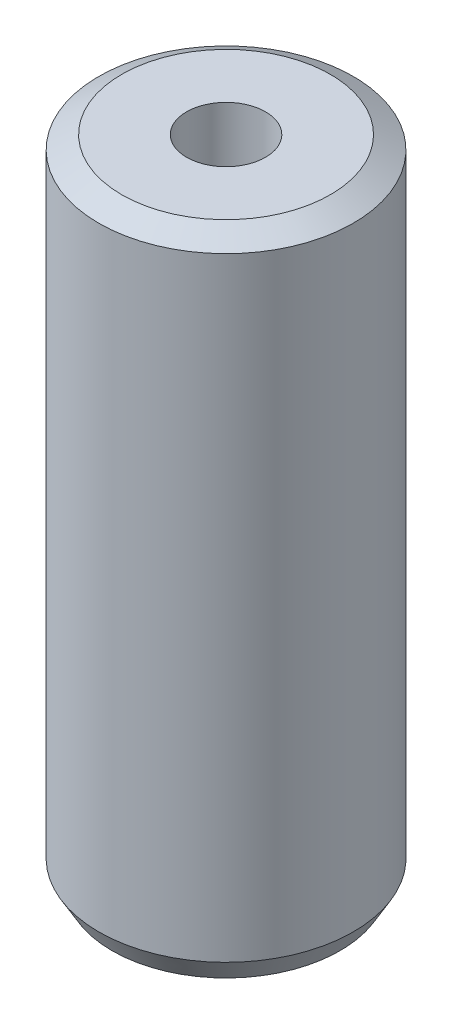
ISO-10303-21;
HEADER;
FILE_DESCRIPTION(('STEP AP214'),'2;1');
FILE_NAME('part.step','',(''),(''),'','','');
FILE_SCHEMA(('AUTOMOTIVE_DESIGN { 1 0 10303 214 1 1 1 1 }'));
ENDSEC;
DATA;
#1=APPLICATION_CONTEXT('core data for automotive mechanical design processes');
#2=APPLICATION_PROTOCOL_DEFINITION('international standard','automotive_design',2000,#1);
#3=PRODUCT_CONTEXT('',#1,'mechanical');
#4=PRODUCT('Part','Part','',(#3));
#5=PRODUCT_RELATED_PRODUCT_CATEGORY('part','',(#4));
#6=PRODUCT_DEFINITION_FORMATION('','',#4);
#7=PRODUCT_DEFINITION_CONTEXT('part definition',#1,'design');
#8=PRODUCT_DEFINITION('design','',#6,#7);
#9=PRODUCT_DEFINITION_SHAPE('','',#8);
#10=(LENGTH_UNIT() NAMED_UNIT(*) SI_UNIT(.MILLI.,.METRE.));
#11=(NAMED_UNIT(*) PLANE_ANGLE_UNIT() SI_UNIT($,.RADIAN.));
#12=(NAMED_UNIT(*) SI_UNIT($,.STERADIAN.) SOLID_ANGLE_UNIT());
#13=UNCERTAINTY_MEASURE_WITH_UNIT(LENGTH_MEASURE(1.E-05),#10,'distance_accuracy_value','');
#14=(GEOMETRIC_REPRESENTATION_CONTEXT(3) GLOBAL_UNCERTAINTY_ASSIGNED_CONTEXT((#13)) GLOBAL_UNIT_ASSIGNED_CONTEXT((#10,
#11,#12)) REPRESENTATION_CONTEXT('',''));
#15=CARTESIAN_POINT('',(0.,0.,0.));
#16=DIRECTION('',(0.,0.,1.));
#17=DIRECTION('',(1.,0.,0.));
#18=AXIS2_PLACEMENT_3D('',#15,#16,#17);
#19=CARTESIAN_POINT('',(0.,89.3925338737181,0.));
#20=DIRECTION('',(0.,-1.,0.));
#21=DIRECTION('',(0.,0.,-1.));
#22=AXIS2_PLACEMENT_3D('',#19,#20,#21);
#23=CYLINDRICAL_SURFACE('',#22,17.5);
#24=CARTESIAN_POINT('',(0.,87.5722599533696,0.));
#25=DIRECTION('',(0.,1.,0.));
#26=DIRECTION('',(0.,0.,1.));
#27=AXIS2_PLACEMENT_3D('',#24,#25,#26);
#28=CIRCLE('',#27,17.5);
#29=CARTESIAN_POINT('',(0.,87.5722599533696,17.5));
#30=VERTEX_POINT('',#29);
#31=EDGE_CURVE('E50',#30,#30,#28,.F.);
#32=ORIENTED_EDGE('',*,*,#31,.T.);
#33=EDGE_LOOP('',(#32));
#34=FACE_BOUND('',#33,.T.);
#35=CARTESIAN_POINT('',(0.,3.15280691373623,0.));
#36=DIRECTION('',(0.,1.,0.));
#37=DIRECTION('',(0.,0.,1.));
#38=AXIS2_PLACEMENT_3D('',#35,#36,#37);
#39=CIRCLE('',#38,17.5);
#40=CARTESIAN_POINT('',(0.,3.15280691373623,17.5));
#41=VERTEX_POINT('',#40);
#42=EDGE_CURVE('E51',#41,#41,#39,.T.);
#43=ORIENTED_EDGE('',*,*,#42,.T.);
#44=EDGE_LOOP('',(#43));
#45=FACE_BOUND('',#44,.T.);
#46=ADVANCED_FACE('F39',(#34,#45),#23,.T.);
#47=CARTESIAN_POINT('',(0.,89.3925338737181,0.));
#48=DIRECTION('',(0.,1.,0.));
#49=DIRECTION('',(0.,0.,1.));
#50=AXIS2_PLACEMENT_3D('',#47,#48,#49);
#51=PLANE('',#50);
#52=CARTESIAN_POINT('',(0.,89.3925338737181,0.));
#53=DIRECTION('',(0.,1.,0.));
#54=DIRECTION('',(0.,0.,1.));
#55=AXIS2_PLACEMENT_3D('',#52,#53,#54);
#56=CIRCLE('',#55,14.3471930862637);
#57=CARTESIAN_POINT('',(0.,89.3925338737181,14.3471930862637));
#58=VERTEX_POINT('',#57);
#59=EDGE_CURVE('E54',#58,#58,#56,.T.);
#60=ORIENTED_EDGE('',*,*,#59,.T.);
#61=EDGE_LOOP('',(#60));
#62=FACE_BOUND('',#61,.T.);
#63=CARTESIAN_POINT('',(0.,89.3925338737181,0.));
#64=DIRECTION('',(0.,1.,0.));
#65=DIRECTION('',(0.,0.,1.));
#66=AXIS2_PLACEMENT_3D('',#63,#64,#65);
#67=CIRCLE('',#66,5.42739893584074);
#68=CARTESIAN_POINT('',(0.,89.3925338737181,5.42739893584074));
#69=VERTEX_POINT('',#68);
#70=EDGE_CURVE('E58',#69,#69,#67,.T.);
#71=ORIENTED_EDGE('',*,*,#70,.F.);
#72=EDGE_LOOP('',(#71));
#73=FACE_BOUND('',#72,.T.);
#74=ADVANCED_FACE('F69',(#62,#73),#51,.T.);
#75=CARTESIAN_POINT('',(0.,0.,0.));
#76=DIRECTION('',(0.,1.,0.));
#77=DIRECTION('',(0.,0.,1.));
#78=AXIS2_PLACEMENT_3D('',#75,#76,#77);
#79=PLANE('',#78);
#80=CARTESIAN_POINT('',(0.,0.,0.));
#81=DIRECTION('',(0.,1.,0.));
#82=DIRECTION('',(0.,0.,1.));
#83=AXIS2_PLACEMENT_3D('',#80,#81,#82);
#84=CIRCLE('',#83,15.6797260796515);
#85=CARTESIAN_POINT('',(0.,0.,15.6797260796515));
#86=VERTEX_POINT('',#85);
#87=EDGE_CURVE('E10',#86,#86,#84,.F.);
#88=ORIENTED_EDGE('',*,*,#87,.T.);
#89=EDGE_LOOP('',(#88));
#90=FACE_BOUND('',#89,.T.);
#91=CARTESIAN_POINT('',(0.,0.,0.));
#92=DIRECTION('',(0.,1.,0.));
#93=DIRECTION('',(0.,0.,1.));
#94=AXIS2_PLACEMENT_3D('',#91,#92,#93);
#95=CIRCLE('',#94,5.42739893584074);
#96=CARTESIAN_POINT('',(0.,0.,5.42739893584074));
#97=VERTEX_POINT('',#96);
#98=EDGE_CURVE('E63',#97,#97,#95,.T.);
#99=ORIENTED_EDGE('',*,*,#98,.T.);
#100=EDGE_LOOP('',(#99));
#101=FACE_BOUND('',#100,.T.);
#102=ADVANCED_FACE('F75',(#90,#101),#79,.F.);
#103=CARTESIAN_POINT('',(0.,89.3925338737181,0.));
#104=DIRECTION('',(0.,-1.,0.));
#105=DIRECTION('',(0.,0.,-1.));
#106=AXIS2_PLACEMENT_3D('',#103,#104,#105);
#107=CYLINDRICAL_SURFACE('',#106,5.42739893584074);
#108=ORIENTED_EDGE('',*,*,#70,.T.);
#109=EDGE_LOOP('',(#108));
#110=FACE_BOUND('',#109,.T.);
#111=ORIENTED_EDGE('',*,*,#98,.F.);
#112=EDGE_LOOP('',(#111));
#113=FACE_BOUND('',#112,.T.);
#114=ADVANCED_FACE('F70',(#110,#113),#107,.F.);
#115=CARTESIAN_POINT('',(0.,89.3925338737181,0.));
#116=DIRECTION('',(0.,-1.,0.));
#117=DIRECTION('',(0.,0.,-1.));
#118=AXIS2_PLACEMENT_3D('',#115,#116,#117);
#119=CONICAL_SURFACE('',#118,14.3471930862637,1.0471975511966);
#120=ORIENTED_EDGE('',*,*,#31,.F.);
#121=EDGE_LOOP('',(#120));
#122=FACE_BOUND('',#121,.T.);
#123=ORIENTED_EDGE('',*,*,#59,.F.);
#124=EDGE_LOOP('',(#123));
#125=FACE_BOUND('',#124,.T.);
#126=ADVANCED_FACE('F81',(#122,#125),#119,.T.);
#127=CARTESIAN_POINT('',(0.,3.15280691373623,0.));
#128=DIRECTION('',(0.,1.,0.));
#129=DIRECTION('',(0.,0.,1.));
#130=AXIS2_PLACEMENT_3D('',#127,#128,#129);
#131=CONICAL_SURFACE('',#130,17.5,0.523598775598302);
#132=CARTESIAN_POINT('',(0.,0.,15.6797260796515));
#133=CARTESIAN_POINT('',(0.,0.0328417386847523,15.6986872663218));
#134=CARTESIAN_POINT('',(0.,0.0656834773695046,15.7176484529921));
#135=CARTESIAN_POINT('',(0.,0.131366954739009,15.7555708263327));
#136=CARTESIAN_POINT('',(0.,0.164208693423761,15.774532013003));
#137=CARTESIAN_POINT('',(0.,0.229892170793266,15.8124543863435));
#138=CARTESIAN_POINT('',(0.,0.262733909478019,15.8314155730138));
#139=CARTESIAN_POINT('',(0.,0.328417386847524,15.8693379463544));
#140=CARTESIAN_POINT('',(0.,0.361259125532276,15.8882991330247));
#141=CARTESIAN_POINT('',(0.,0.426942602901781,15.9262215063653));
#142=CARTESIAN_POINT('',(0.,0.459784341586534,15.9451826930356));
#143=CARTESIAN_POINT('',(0.,0.525467818956039,15.9831050663762));
#144=CARTESIAN_POINT('',(0.,0.558309557640791,16.0020662530465));
#145=CARTESIAN_POINT('',(0.,0.623993035010296,16.0399886263871));
#146=CARTESIAN_POINT('',(0.,0.656834773695048,16.0589498130574));
#147=CARTESIAN_POINT('',(0.,0.722518251064553,16.096872186398));
#148=CARTESIAN_POINT('',(0.,0.755359989749305,16.1158333730683));
#149=CARTESIAN_POINT('',(0.,0.82104346711881,16.1537557464089));
#150=CARTESIAN_POINT('',(0.,0.853885205803563,16.1727169330792));
#151=CARTESIAN_POINT('',(0.,0.919568683173068,16.2106393064198));
#152=CARTESIAN_POINT('',(0.,0.95241042185782,16.2296004930901));
#153=CARTESIAN_POINT('',(0.,1.01809389922732,16.2675228664307));
#154=CARTESIAN_POINT('',(0.,1.05093563791208,16.286484053101));
#155=CARTESIAN_POINT('',(0.,1.11661911528158,16.3244064264416));
#156=CARTESIAN_POINT('',(0.,1.14946085396633,16.3433676131119));
#157=CARTESIAN_POINT('',(0.,1.21514433133584,16.3812899864525));
#158=CARTESIAN_POINT('',(0.,1.24798607002059,16.4002511731228));
#159=CARTESIAN_POINT('',(0.,1.3136695473901,16.4381735464634));
#160=CARTESIAN_POINT('',(0.,1.34651128607485,16.4571347331337));
#161=CARTESIAN_POINT('',(0.,1.41219476344435,16.4950571064742));
#162=CARTESIAN_POINT('',(0.,1.44503650212911,16.5140182931445));
#163=CARTESIAN_POINT('',(0.,1.51071997949861,16.5519406664851));
#164=CARTESIAN_POINT('',(0.,1.54356171818336,16.5709018531554));
#165=CARTESIAN_POINT('',(0.,1.60924519555287,16.608824226496));
#166=CARTESIAN_POINT('',(0.,1.64208693423762,16.6277854131663));
#167=CARTESIAN_POINT('',(0.,1.70777041160713,16.6657077865069));
#168=CARTESIAN_POINT('',(0.,1.74061215029188,16.6846689731772));
#169=CARTESIAN_POINT('',(0.,1.80629562766138,16.7225913465178));
#170=CARTESIAN_POINT('',(0.,1.83913736634614,16.7415525331881));
#171=CARTESIAN_POINT('',(0.,1.90482084371564,16.7794749065287));
#172=CARTESIAN_POINT('',(0.,1.93766258240039,16.798436093199));
#173=CARTESIAN_POINT('',(0.,2.0033460597699,16.8363584665396));
#174=CARTESIAN_POINT('',(0.,2.03618779845465,16.8553196532099));
#175=CARTESIAN_POINT('',(0.,2.10187127582416,16.8932420265505));
#176=CARTESIAN_POINT('',(0.,2.13471301450891,16.9122032132208));
#177=CARTESIAN_POINT('',(0.,2.20039649187841,16.9501255865614));
#178=CARTESIAN_POINT('',(0.,2.23323823056317,16.9690867732317));
#179=CARTESIAN_POINT('',(0.,2.29892170793267,17.0070091465723));
#180=CARTESIAN_POINT('',(0.,2.33176344661742,17.0259703332426));
#181=CARTESIAN_POINT('',(0.,2.39744692398693,17.0638927065832));
#182=CARTESIAN_POINT('',(0.,2.43028866267168,17.0828538932535));
#183=CARTESIAN_POINT('',(0.,2.49597214004118,17.1207762665941));
#184=CARTESIAN_POINT('',(0.,2.52881387872594,17.1397374532644));
#185=CARTESIAN_POINT('',(0.,2.59449735609544,17.177659826605));
#186=CARTESIAN_POINT('',(0.,2.62733909478019,17.1966210132752));
#187=CARTESIAN_POINT('',(0.,2.6930225721497,17.2345433866158));
#188=CARTESIAN_POINT('',(0.,2.72586431083445,17.2535045732861));
#189=CARTESIAN_POINT('',(0.,2.79154778820396,17.2914269466267));
#190=CARTESIAN_POINT('',(0.,2.82438952688871,17.310388133297));
#191=CARTESIAN_POINT('',(0.,2.89007300425821,17.3483105066376));
#192=CARTESIAN_POINT('',(0.,2.92291474294297,17.3672716933079));
#193=CARTESIAN_POINT('',(0.,2.98859822031247,17.4051940666485));
#194=CARTESIAN_POINT('',(0.,3.02143995899722,17.4241552533188));
#195=CARTESIAN_POINT('',(0.,3.08712343636673,17.4620776266594));
#196=CARTESIAN_POINT('',(0.,3.11996517505148,17.4810388133297));
#197=CARTESIAN_POINT('',(0.,3.15280691373623,17.5));
#198=B_SPLINE_CURVE_WITH_KNOTS('',3,(#132,#133,#134,#135,#136,#137,#138,#139,#140,#141,#142,
#143,#144,#145,#146,#147,#148,#149,#150,#151,#152,#153,#154,#155,#156,#157,#158,#159,#160,#161,
#162,#163,#164,#165,#166,#167,#168,#169,#170,#171,#172,#173,#174,#175,#176,#177,#178,#179,#180,
#181,#182,#183,#184,#185,#186,#187,#188,#189,#190,#191,#192,#193,#194,#195,#196,#197),
.UNSPECIFIED.,.F.,.F.,(4,2,2,2,2,2,2,2,2,2,2,2,2,2,2,2,2,2,2,2,2,2,2,2,2,2,2,2,2,2,2,2,4),(0.,
0.113767120021783,0.227534240043567,0.341301360065349,0.455068480087132,0.568835600108916,
0.682602720130699,0.796369840152483,0.910136960174266,1.02390408019605,1.13767120021783,
1.25143832023961,1.3652054402614,1.47897256028318,1.59273968030496,1.70650680032675,
1.82027392034853,1.93404104037031,2.0478081603921,2.16157528041388,2.27534240043566,
2.38910952045745,2.50287664047923,2.61664376050101,2.7304108805228,2.84417800054458,
2.95794512056636,3.07171224058815,3.18547936060993,3.29924648063171,3.4130136006535,
3.52678072067528,3.64054784069706),.UNSPECIFIED.);
#199=EDGE_CURVE('BSEAM45',#86,#41,#198,.T.);
#200=ORIENTED_EDGE('',*,*,#87,.F.);
#201=ORIENTED_EDGE('',*,*,#42,.F.);
#202=ORIENTED_EDGE('',*,*,#199,.T.);
#203=ORIENTED_EDGE('',*,*,#199,.F.);
#204=EDGE_LOOP('',(#200,#202,#201,#203));
#205=FACE_BOUND('',#204,.T.);
#206=ADVANCED_FACE('F45',(#205),#131,.T.);
#207=CLOSED_SHELL('',(#46,#74,#102,#114,#126,#206));
#208=MANIFOLD_SOLID_BREP('B2',#207);
#209=ADVANCED_BREP_SHAPE_REPRESENTATION('',(#18,#208),#14);
#210=SHAPE_DEFINITION_REPRESENTATION(#9,#209);
ENDSEC;
END-ISO-10303-21;
